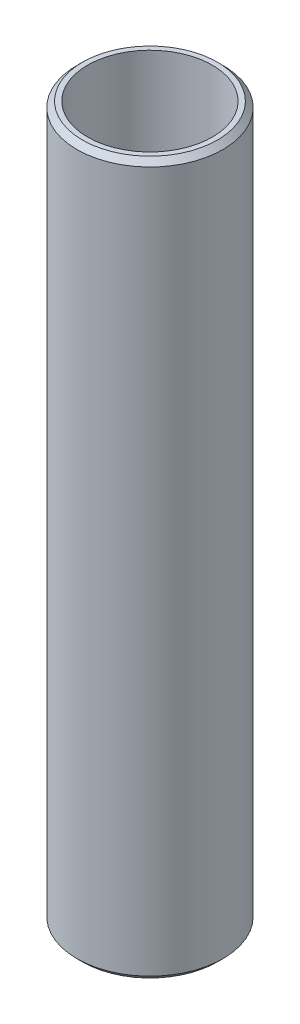
ISO-10303-21;
HEADER;
FILE_DESCRIPTION(('STEP AP214'),'2;1');
FILE_NAME('part.step','',(''),(''),'','','');
FILE_SCHEMA(('AUTOMOTIVE_DESIGN { 1 0 10303 214 1 1 1 1 }'));
ENDSEC;
DATA;
#1=APPLICATION_CONTEXT('core data for automotive mechanical design processes');
#2=APPLICATION_PROTOCOL_DEFINITION('international standard','automotive_design',2000,#1);
#3=PRODUCT_CONTEXT('',#1,'mechanical');
#4=PRODUCT('Part','Part','',(#3));
#5=PRODUCT_RELATED_PRODUCT_CATEGORY('part','',(#4));
#6=PRODUCT_DEFINITION_FORMATION('','',#4);
#7=PRODUCT_DEFINITION_CONTEXT('part definition',#1,'design');
#8=PRODUCT_DEFINITION('design','',#6,#7);
#9=PRODUCT_DEFINITION_SHAPE('','',#8);
#10=(LENGTH_UNIT() NAMED_UNIT(*) SI_UNIT(.MILLI.,.METRE.));
#11=(NAMED_UNIT(*) PLANE_ANGLE_UNIT() SI_UNIT($,.RADIAN.));
#12=(NAMED_UNIT(*) SI_UNIT($,.STERADIAN.) SOLID_ANGLE_UNIT());
#13=UNCERTAINTY_MEASURE_WITH_UNIT(LENGTH_MEASURE(1.E-05),#10,'distance_accuracy_value','');
#14=(GEOMETRIC_REPRESENTATION_CONTEXT(3) GLOBAL_UNCERTAINTY_ASSIGNED_CONTEXT((#13)) GLOBAL_UNIT_ASSIGNED_CONTEXT((#10,
#11,#12)) REPRESENTATION_CONTEXT('',''));
#15=CARTESIAN_POINT('',(0.,0.,0.));
#16=DIRECTION('',(0.,0.,1.));
#17=DIRECTION('',(1.,0.,0.));
#18=AXIS2_PLACEMENT_3D('',#15,#16,#17);
#19=CARTESIAN_POINT('',(0.,585.043131396586,0.));
#20=DIRECTION('',(0.,-1.,0.));
#21=DIRECTION('',(0.,0.,-1.));
#22=AXIS2_PLACEMENT_3D('',#19,#20,#21);
#23=CYLINDRICAL_SURFACE('',#22,60.);
#24=CARTESIAN_POINT('',(0.,580.525813705753,0.));
#25=DIRECTION('',(0.,1.,0.));
#26=DIRECTION('',(0.,0.,1.));
#27=AXIS2_PLACEMENT_3D('',#24,#25,#26);
#28=CIRCLE('',#27,60.);
#29=CARTESIAN_POINT('',(0.,580.525813705753,60.));
#30=VERTEX_POINT('',#29);
#31=EDGE_CURVE('E50',#30,#30,#28,.F.);
#32=ORIENTED_EDGE('',*,*,#31,.T.);
#33=EDGE_LOOP('',(#32));
#34=FACE_BOUND('',#33,.T.);
#35=CARTESIAN_POINT('',(0.,4.51731769083286,0.));
#36=DIRECTION('',(0.,1.,0.));
#37=DIRECTION('',(0.,0.,1.));
#38=AXIS2_PLACEMENT_3D('',#35,#36,#37);
#39=CIRCLE('',#38,60.);
#40=CARTESIAN_POINT('',(0.,4.51731769083286,60.));
#41=VERTEX_POINT('',#40);
#42=EDGE_CURVE('E51',#41,#41,#39,.T.);
#43=ORIENTED_EDGE('',*,*,#42,.T.);
#44=EDGE_LOOP('',(#43));
#45=FACE_BOUND('',#44,.T.);
#46=ADVANCED_FACE('F39',(#34,#45),#23,.T.);
#47=CARTESIAN_POINT('',(0.,585.043131396586,0.));
#48=DIRECTION('',(0.,1.,0.));
#49=DIRECTION('',(0.,0.,1.));
#50=AXIS2_PLACEMENT_3D('',#47,#48,#49);
#51=PLANE('',#50);
#52=CARTESIAN_POINT('',(0.,585.043131396586,0.));
#53=DIRECTION('',(0.,1.,0.));
#54=DIRECTION('',(0.,0.,1.));
#55=AXIS2_PLACEMENT_3D('',#52,#53,#54);
#56=CIRCLE('',#55,55.4826823091671);
#57=CARTESIAN_POINT('',(0.,585.043131396586,55.4826823091671));
#58=VERTEX_POINT('',#57);
#59=EDGE_CURVE('E54',#58,#58,#56,.T.);
#60=ORIENTED_EDGE('',*,*,#59,.T.);
#61=EDGE_LOOP('',(#60));
#62=FACE_BOUND('',#61,.T.);
#63=CARTESIAN_POINT('',(0.,585.043131396586,0.));
#64=DIRECTION('',(0.,1.,0.));
#65=DIRECTION('',(0.,0.,1.));
#66=AXIS2_PLACEMENT_3D('',#63,#64,#65);
#67=CIRCLE('',#66,51.2705124690315);
#68=CARTESIAN_POINT('',(0.,585.043131396586,51.2705124690315));
#69=VERTEX_POINT('',#68);
#70=EDGE_CURVE('E58',#69,#69,#67,.T.);
#71=ORIENTED_EDGE('',*,*,#70,.F.);
#72=EDGE_LOOP('',(#71));
#73=FACE_BOUND('',#72,.T.);
#74=ADVANCED_FACE('F69',(#62,#73),#51,.T.);
#75=CARTESIAN_POINT('',(0.,0.,0.));
#76=DIRECTION('',(0.,1.,0.));
#77=DIRECTION('',(0.,0.,1.));
#78=AXIS2_PLACEMENT_3D('',#75,#76,#77);
#79=PLANE('',#78);
#80=CARTESIAN_POINT('',(0.,0.,0.));
#81=DIRECTION('',(0.,1.,0.));
#82=DIRECTION('',(0.,0.,1.));
#83=AXIS2_PLACEMENT_3D('',#80,#81,#82);
#84=CIRCLE('',#83,55.4826823091671);
#85=CARTESIAN_POINT('',(0.,0.,55.4826823091671));
#86=VERTEX_POINT('',#85);
#87=EDGE_CURVE('E10',#86,#86,#84,.F.);
#88=ORIENTED_EDGE('',*,*,#87,.T.);
#89=EDGE_LOOP('',(#88));
#90=FACE_BOUND('',#89,.T.);
#91=CARTESIAN_POINT('',(0.,0.,0.));
#92=DIRECTION('',(0.,1.,0.));
#93=DIRECTION('',(0.,0.,1.));
#94=AXIS2_PLACEMENT_3D('',#91,#92,#93);
#95=CIRCLE('',#94,51.2705124690315);
#96=CARTESIAN_POINT('',(0.,0.,51.2705124690315));
#97=VERTEX_POINT('',#96);
#98=EDGE_CURVE('E63',#97,#97,#95,.T.);
#99=ORIENTED_EDGE('',*,*,#98,.T.);
#100=EDGE_LOOP('',(#99));
#101=FACE_BOUND('',#100,.T.);
#102=ADVANCED_FACE('F75',(#90,#101),#79,.F.);
#103=CARTESIAN_POINT('',(0.,585.043131396586,0.));
#104=DIRECTION('',(0.,-1.,0.));
#105=DIRECTION('',(0.,0.,-1.));
#106=AXIS2_PLACEMENT_3D('',#103,#104,#105);
#107=CYLINDRICAL_SURFACE('',#106,51.2705124690315);
#108=ORIENTED_EDGE('',*,*,#70,.T.);
#109=EDGE_LOOP('',(#108));
#110=FACE_BOUND('',#109,.T.);
#111=ORIENTED_EDGE('',*,*,#98,.F.);
#112=EDGE_LOOP('',(#111));
#113=FACE_BOUND('',#112,.T.);
#114=ADVANCED_FACE('F70',(#110,#113),#107,.F.);
#115=CARTESIAN_POINT('',(0.,585.043131396586,0.));
#116=DIRECTION('',(0.,-1.,0.));
#117=DIRECTION('',(0.,0.,-1.));
#118=AXIS2_PLACEMENT_3D('',#115,#116,#117);
#119=CONICAL_SURFACE('',#118,55.4826823091671,0.785398163397448);
#120=ORIENTED_EDGE('',*,*,#31,.F.);
#121=EDGE_LOOP('',(#120));
#122=FACE_BOUND('',#121,.T.);
#123=ORIENTED_EDGE('',*,*,#59,.F.);
#124=EDGE_LOOP('',(#123));
#125=FACE_BOUND('',#124,.T.);
#126=ADVANCED_FACE('F81',(#122,#125),#119,.T.);
#127=CARTESIAN_POINT('',(0.,4.51731769083286,0.));
#128=DIRECTION('',(0.,1.,0.));
#129=DIRECTION('',(0.,0.,1.));
#130=AXIS2_PLACEMENT_3D('',#127,#128,#129);
#131=CONICAL_SURFACE('',#130,60.,0.785398163397454);
#132=ORIENTED_EDGE('',*,*,#87,.F.);
#133=EDGE_LOOP('',(#132));
#134=FACE_BOUND('',#133,.T.);
#135=ORIENTED_EDGE('',*,*,#42,.F.);
#136=EDGE_LOOP('',(#135));
#137=FACE_BOUND('',#136,.T.);
#138=ADVANCED_FACE('F45',(#134,#137),#131,.T.);
#139=CLOSED_SHELL('',(#46,#74,#102,#114,#126,#138));
#140=MANIFOLD_SOLID_BREP('B2',#139);
#141=ADVANCED_BREP_SHAPE_REPRESENTATION('',(#18,#140),#14);
#142=SHAPE_DEFINITION_REPRESENTATION(#9,#141);
ENDSEC;
END-ISO-10303-21;
